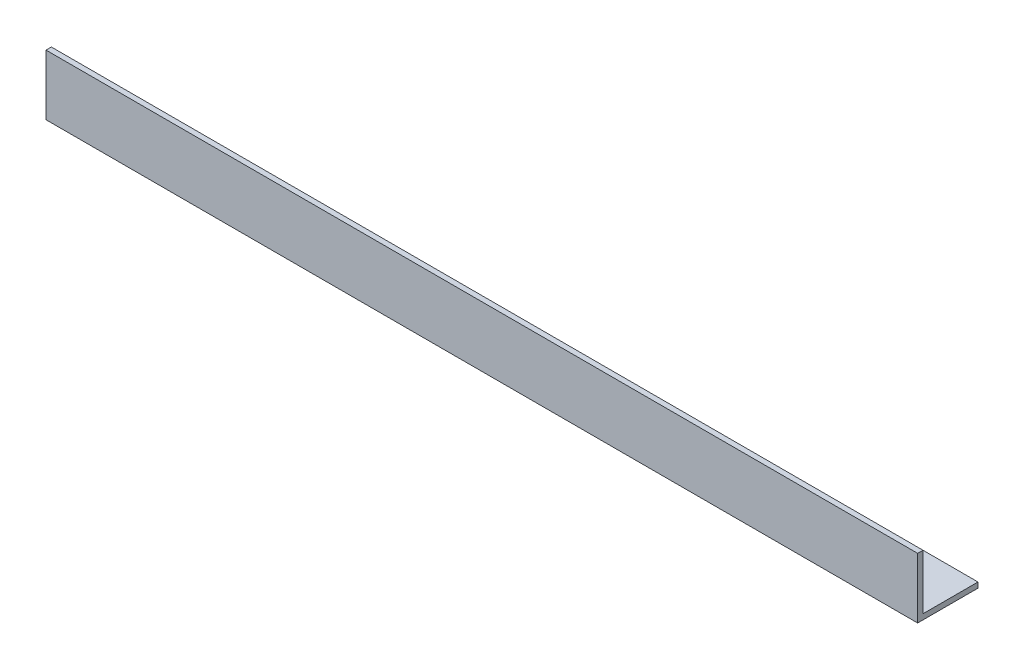
ISO-10303-21;
HEADER;
FILE_DESCRIPTION(('STEP AP214'),'2;1');
FILE_NAME('part.step','',(''),(''),'','','');
FILE_SCHEMA(('AUTOMOTIVE_DESIGN { 1 0 10303 214 1 1 1 1 }'));
ENDSEC;
DATA;
#1=APPLICATION_CONTEXT('core data for automotive mechanical design processes');
#2=APPLICATION_PROTOCOL_DEFINITION('international standard','automotive_design',2000,#1);
#3=PRODUCT_CONTEXT('',#1,'mechanical');
#4=PRODUCT('Part','Part','',(#3));
#5=PRODUCT_RELATED_PRODUCT_CATEGORY('part','',(#4));
#6=PRODUCT_DEFINITION_FORMATION('','',#4);
#7=PRODUCT_DEFINITION_CONTEXT('part definition',#1,'design');
#8=PRODUCT_DEFINITION('design','',#6,#7);
#9=PRODUCT_DEFINITION_SHAPE('','',#8);
#10=(LENGTH_UNIT() NAMED_UNIT(*) SI_UNIT(.MILLI.,.METRE.));
#11=(NAMED_UNIT(*) PLANE_ANGLE_UNIT() SI_UNIT($,.RADIAN.));
#12=(NAMED_UNIT(*) SI_UNIT($,.STERADIAN.) SOLID_ANGLE_UNIT());
#13=UNCERTAINTY_MEASURE_WITH_UNIT(LENGTH_MEASURE(1.E-05),#10,'distance_accuracy_value','');
#14=(GEOMETRIC_REPRESENTATION_CONTEXT(3) GLOBAL_UNCERTAINTY_ASSIGNED_CONTEXT((#13)) GLOBAL_UNIT_ASSIGNED_CONTEXT((#10,
#11,#12)) REPRESENTATION_CONTEXT('',''));
#15=CARTESIAN_POINT('',(0.,0.,0.));
#16=DIRECTION('',(0.,0.,1.));
#17=DIRECTION('',(1.,0.,0.));
#18=AXIS2_PLACEMENT_3D('',#15,#16,#17);
#19=CARTESIAN_POINT('',(650.,0.,0.));
#20=DIRECTION('',(0.,1.,0.));
#21=DIRECTION('',(0.,0.,1.));
#22=AXIS2_PLACEMENT_3D('',#19,#20,#21);
#23=PLANE('',#22);
#24=DIRECTION('',(0.,0.,-1.));
#25=VECTOR('',#24,1.);
#26=CARTESIAN_POINT('',(0.,0.,0.));
#27=LINE('',#26,#25);
#28=CARTESIAN_POINT('',(0.,0.,0.));
#29=VERTEX_POINT('',#28);
#30=CARTESIAN_POINT('',(0.,0.,-45.));
#31=VERTEX_POINT('',#30);
#32=EDGE_CURVE('E125',#29,#31,#27,.T.);
#33=ORIENTED_EDGE('',*,*,#32,.T.);
#34=DIRECTION('',(-1.,0.,0.));
#35=VECTOR('',#34,1.);
#36=CARTESIAN_POINT('',(650.,0.,-45.));
#37=LINE('',#36,#35);
#38=CARTESIAN_POINT('',(650.,0.,-45.));
#39=VERTEX_POINT('',#38);
#40=EDGE_CURVE('E11',#39,#31,#37,.T.);
#41=ORIENTED_EDGE('',*,*,#40,.F.);
#42=DIRECTION('',(0.,0.,-1.));
#43=VECTOR('',#42,1.);
#44=CARTESIAN_POINT('',(650.,0.,0.));
#45=LINE('',#44,#43);
#46=CARTESIAN_POINT('',(650.,0.,0.));
#47=VERTEX_POINT('',#46);
#48=EDGE_CURVE('E86',#47,#39,#45,.T.);
#49=ORIENTED_EDGE('',*,*,#48,.F.);
#50=DIRECTION('',(-1.,0.,0.));
#51=VECTOR('',#50,1.);
#52=CARTESIAN_POINT('',(650.,0.,0.));
#53=LINE('',#52,#51);
#54=EDGE_CURVE('E121',#47,#29,#53,.T.);
#55=ORIENTED_EDGE('',*,*,#54,.T.);
#56=EDGE_LOOP('',(#33,#41,#49,#55));
#57=FACE_BOUND('',#56,.T.);
#58=ADVANCED_FACE('F39',(#57),#23,.F.);
#59=CARTESIAN_POINT('',(650.,4.,-45.));
#60=DIRECTION('',(0.,0.,-1.));
#61=DIRECTION('',(-1.,0.,0.));
#62=AXIS2_PLACEMENT_3D('',#59,#60,#61);
#63=PLANE('',#62);
#64=DIRECTION('',(0.,-1.,0.));
#65=VECTOR('',#64,1.);
#66=CARTESIAN_POINT('',(0.,4.,-45.));
#67=LINE('',#66,#65);
#68=CARTESIAN_POINT('',(0.,4.,-45.));
#69=VERTEX_POINT('',#68);
#70=EDGE_CURVE('E129',#69,#31,#67,.T.);
#71=ORIENTED_EDGE('',*,*,#70,.F.);
#72=DIRECTION('',(-1.,0.,0.));
#73=VECTOR('',#72,1.);
#74=CARTESIAN_POINT('',(650.,4.,-45.));
#75=LINE('',#74,#73);
#76=CARTESIAN_POINT('',(650.,4.,-45.));
#77=VERTEX_POINT('',#76);
#78=EDGE_CURVE('E48',#77,#69,#75,.T.);
#79=ORIENTED_EDGE('',*,*,#78,.F.);
#80=DIRECTION('',(0.,-1.,0.));
#81=VECTOR('',#80,1.);
#82=CARTESIAN_POINT('',(650.,4.,-45.));
#83=LINE('',#82,#81);
#84=EDGE_CURVE('E225',#77,#39,#83,.T.);
#85=ORIENTED_EDGE('',*,*,#84,.T.);
#86=ORIENTED_EDGE('',*,*,#40,.T.);
#87=EDGE_LOOP('',(#71,#79,#85,#86));
#88=FACE_BOUND('',#87,.T.);
#89=ADVANCED_FACE('F156',(#88),#63,.T.);
#90=CARTESIAN_POINT('',(650.,4.,0.));
#91=DIRECTION('',(0.,1.,0.));
#92=DIRECTION('',(0.,0.,1.));
#93=AXIS2_PLACEMENT_3D('',#90,#91,#92);
#94=PLANE('',#93);
#95=DIRECTION('',(0.,0.,-1.));
#96=VECTOR('',#95,1.);
#97=CARTESIAN_POINT('',(0.,4.,0.));
#98=LINE('',#97,#96);
#99=CARTESIAN_POINT('',(0.,4.,-4.));
#100=VERTEX_POINT('',#99);
#101=EDGE_CURVE('E133',#100,#69,#98,.T.);
#102=ORIENTED_EDGE('',*,*,#101,.F.);
#103=DIRECTION('',(-1.,0.,0.));
#104=VECTOR('',#103,1.);
#105=CARTESIAN_POINT('',(650.,4.,-4.));
#106=LINE('',#105,#104);
#107=CARTESIAN_POINT('',(650.,4.,-4.));
#108=VERTEX_POINT('',#107);
#109=EDGE_CURVE('E108',#108,#100,#106,.T.);
#110=ORIENTED_EDGE('',*,*,#109,.F.);
#111=DIRECTION('',(0.,0.,-1.));
#112=VECTOR('',#111,1.);
#113=CARTESIAN_POINT('',(650.,4.,0.));
#114=LINE('',#113,#112);
#115=EDGE_CURVE('E114',#108,#77,#114,.T.);
#116=ORIENTED_EDGE('',*,*,#115,.T.);
#117=ORIENTED_EDGE('',*,*,#78,.T.);
#118=EDGE_LOOP('',(#102,#110,#116,#117));
#119=FACE_BOUND('',#118,.T.);
#120=ADVANCED_FACE('F153',(#119),#94,.T.);
#121=CARTESIAN_POINT('',(650.,45.,-4.));
#122=DIRECTION('',(0.,0.,-1.));
#123=DIRECTION('',(0.,1.,0.));
#124=AXIS2_PLACEMENT_3D('',#121,#122,#123);
#125=PLANE('',#124);
#126=DIRECTION('',(0.,-1.,0.));
#127=VECTOR('',#126,1.);
#128=CARTESIAN_POINT('',(0.,45.,-4.));
#129=LINE('',#128,#127);
#130=CARTESIAN_POINT('',(0.,45.,-4.));
#131=VERTEX_POINT('',#130);
#132=EDGE_CURVE('E102',#131,#100,#129,.T.);
#133=ORIENTED_EDGE('',*,*,#132,.F.);
#134=DIRECTION('',(-1.,0.,0.));
#135=VECTOR('',#134,1.);
#136=CARTESIAN_POINT('',(650.,45.,-4.));
#137=LINE('',#136,#135);
#138=CARTESIAN_POINT('',(650.,45.,-4.));
#139=VERTEX_POINT('',#138);
#140=EDGE_CURVE('E97',#139,#131,#137,.T.);
#141=ORIENTED_EDGE('',*,*,#140,.F.);
#142=DIRECTION('',(0.,-1.,0.));
#143=VECTOR('',#142,1.);
#144=CARTESIAN_POINT('',(650.,45.,-4.));
#145=LINE('',#144,#143);
#146=EDGE_CURVE('E100',#139,#108,#145,.T.);
#147=ORIENTED_EDGE('',*,*,#146,.T.);
#148=ORIENTED_EDGE('',*,*,#109,.T.);
#149=EDGE_LOOP('',(#133,#141,#147,#148));
#150=FACE_BOUND('',#149,.T.);
#151=ADVANCED_FACE('F99',(#150),#125,.T.);
#152=CARTESIAN_POINT('',(650.,45.,0.));
#153=DIRECTION('',(0.,1.,0.));
#154=DIRECTION('',(0.,0.,1.));
#155=AXIS2_PLACEMENT_3D('',#152,#153,#154);
#156=PLANE('',#155);
#157=DIRECTION('',(0.,0.,-1.));
#158=VECTOR('',#157,1.);
#159=CARTESIAN_POINT('',(0.,45.,0.));
#160=LINE('',#159,#158);
#161=CARTESIAN_POINT('',(0.,45.,0.));
#162=VERTEX_POINT('',#161);
#163=EDGE_CURVE('E139',#162,#131,#160,.T.);
#164=ORIENTED_EDGE('',*,*,#163,.F.);
#165=DIRECTION('',(-1.,0.,0.));
#166=VECTOR('',#165,1.);
#167=CARTESIAN_POINT('',(650.,45.,0.));
#168=LINE('',#167,#166);
#169=CARTESIAN_POINT('',(650.,45.,0.));
#170=VERTEX_POINT('',#169);
#171=EDGE_CURVE('E77',#170,#162,#168,.T.);
#172=ORIENTED_EDGE('',*,*,#171,.F.);
#173=DIRECTION('',(0.,0.,-1.));
#174=VECTOR('',#173,1.);
#175=CARTESIAN_POINT('',(650.,45.,0.));
#176=LINE('',#175,#174);
#177=EDGE_CURVE('E112',#170,#139,#176,.T.);
#178=ORIENTED_EDGE('',*,*,#177,.T.);
#179=ORIENTED_EDGE('',*,*,#140,.T.);
#180=EDGE_LOOP('',(#164,#172,#178,#179));
#181=FACE_BOUND('',#180,.T.);
#182=ADVANCED_FACE('F117',(#181),#156,.T.);
#183=CARTESIAN_POINT('',(650.,45.,0.));
#184=DIRECTION('',(0.,0.,-1.));
#185=DIRECTION('',(0.,1.,0.));
#186=AXIS2_PLACEMENT_3D('',#183,#184,#185);
#187=PLANE('',#186);
#188=DIRECTION('',(0.,-1.,0.));
#189=VECTOR('',#188,1.);
#190=CARTESIAN_POINT('',(0.,45.,0.));
#191=LINE('',#190,#189);
#192=EDGE_CURVE('E80',#162,#29,#191,.T.);
#193=ORIENTED_EDGE('',*,*,#192,.T.);
#194=ORIENTED_EDGE('',*,*,#54,.F.);
#195=DIRECTION('',(0.,-1.,0.));
#196=VECTOR('',#195,1.);
#197=CARTESIAN_POINT('',(650.,45.,0.));
#198=LINE('',#197,#196);
#199=EDGE_CURVE('E56',#170,#47,#198,.T.);
#200=ORIENTED_EDGE('',*,*,#199,.F.);
#201=ORIENTED_EDGE('',*,*,#171,.T.);
#202=EDGE_LOOP('',(#193,#194,#200,#201));
#203=FACE_BOUND('',#202,.T.);
#204=ADVANCED_FACE('F161',(#203),#187,.F.);
#205=CARTESIAN_POINT('',(650.,0.,0.));
#206=DIRECTION('',(-1.,0.,0.));
#207=DIRECTION('',(0.,0.,1.));
#208=AXIS2_PLACEMENT_3D('',#205,#206,#207);
#209=PLANE('',#208);
#210=ORIENTED_EDGE('',*,*,#48,.T.);
#211=ORIENTED_EDGE('',*,*,#84,.F.);
#212=ORIENTED_EDGE('',*,*,#115,.F.);
#213=ORIENTED_EDGE('',*,*,#146,.F.);
#214=ORIENTED_EDGE('',*,*,#177,.F.);
#215=ORIENTED_EDGE('',*,*,#199,.T.);
#216=EDGE_LOOP('',(#210,#211,#212,#213,#214,#215));
#217=FACE_BOUND('',#216,.T.);
#218=ADVANCED_FACE('F111',(#217),#209,.F.);
#219=CARTESIAN_POINT('',(0.,0.,0.));
#220=DIRECTION('',(-1.,0.,0.));
#221=DIRECTION('',(0.,0.,1.));
#222=AXIS2_PLACEMENT_3D('',#219,#220,#221);
#223=PLANE('',#222);
#224=ORIENTED_EDGE('',*,*,#32,.F.);
#225=ORIENTED_EDGE('',*,*,#192,.F.);
#226=ORIENTED_EDGE('',*,*,#163,.T.);
#227=ORIENTED_EDGE('',*,*,#132,.T.);
#228=ORIENTED_EDGE('',*,*,#101,.T.);
#229=ORIENTED_EDGE('',*,*,#70,.T.);
#230=EDGE_LOOP('',(#224,#225,#226,#227,#228,#229));
#231=FACE_BOUND('',#230,.T.);
#232=ADVANCED_FACE('F159',(#231),#223,.T.);
#233=CLOSED_SHELL('',(#58,#89,#120,#151,#182,#204,#218,#232));
#234=MANIFOLD_SOLID_BREP('B2',#233);
#235=ADVANCED_BREP_SHAPE_REPRESENTATION('',(#18,#234),#14);
#236=SHAPE_DEFINITION_REPRESENTATION(#9,#235);
ENDSEC;
END-ISO-10303-21;
